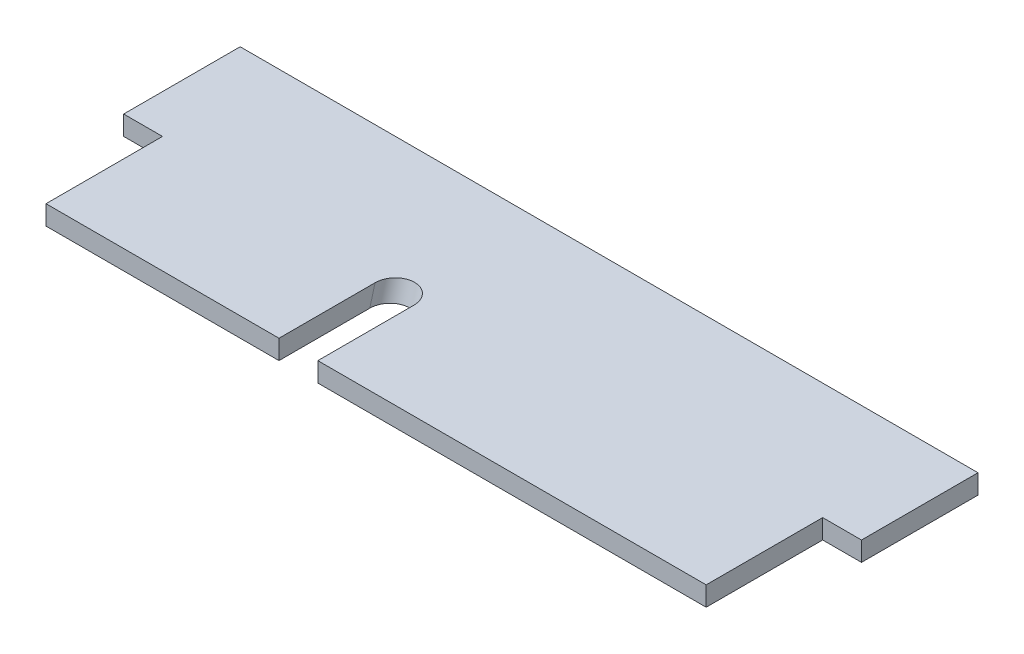
ISO-10303-21;
HEADER;
FILE_DESCRIPTION(('STEP AP214'),'2;1');
FILE_NAME('part.step','',(''),(''),'','','');
FILE_SCHEMA(('AUTOMOTIVE_DESIGN { 1 0 10303 214 1 1 1 1 }'));
ENDSEC;
DATA;
#1=APPLICATION_CONTEXT('core data for automotive mechanical design processes');
#2=APPLICATION_PROTOCOL_DEFINITION('international standard','automotive_design',2000,#1);
#3=PRODUCT_CONTEXT('',#1,'mechanical');
#4=PRODUCT('Part','Part','',(#3));
#5=PRODUCT_RELATED_PRODUCT_CATEGORY('part','',(#4));
#6=PRODUCT_DEFINITION_FORMATION('','',#4);
#7=PRODUCT_DEFINITION_CONTEXT('part definition',#1,'design');
#8=PRODUCT_DEFINITION('design','',#6,#7);
#9=PRODUCT_DEFINITION_SHAPE('','',#8);
#10=(LENGTH_UNIT() NAMED_UNIT(*) SI_UNIT(.MILLI.,.METRE.));
#11=(NAMED_UNIT(*) PLANE_ANGLE_UNIT() SI_UNIT($,.RADIAN.));
#12=(NAMED_UNIT(*) SI_UNIT($,.STERADIAN.) SOLID_ANGLE_UNIT());
#13=UNCERTAINTY_MEASURE_WITH_UNIT(LENGTH_MEASURE(1.E-05),#10,'distance_accuracy_value','');
#14=(GEOMETRIC_REPRESENTATION_CONTEXT(3) GLOBAL_UNCERTAINTY_ASSIGNED_CONTEXT((#13)) GLOBAL_UNIT_ASSIGNED_CONTEXT((#10,
#11,#12)) REPRESENTATION_CONTEXT('',''));
#15=CARTESIAN_POINT('',(0.,0.,0.));
#16=DIRECTION('',(0.,0.,1.));
#17=DIRECTION('',(1.,0.,0.));
#18=AXIS2_PLACEMENT_3D('',#15,#16,#17);
#19=CARTESIAN_POINT('',(-215.9,6.35,76.2));
#20=DIRECTION('',(0.,0.,-1.));
#21=DIRECTION('',(-1.,0.,0.));
#22=AXIS2_PLACEMENT_3D('',#19,#20,#21);
#23=PLANE('',#22);
#24=DIRECTION('',(1.,0.,0.));
#25=VECTOR('',#24,1.);
#26=CARTESIAN_POINT('',(-215.9,-6.35,76.2));
#27=LINE('',#26,#25);
#28=CARTESIAN_POINT('',(-215.9,-6.35,76.2));
#29=VERTEX_POINT('',#28);
#30=CARTESIAN_POINT('',(-63.5,-6.34999999999999,76.2));
#31=VERTEX_POINT('',#30);
#32=EDGE_CURVE('E214',#29,#31,#27,.T.);
#33=ORIENTED_EDGE('',*,*,#32,.T.);
#34=DIRECTION('',(0.,-1.,0.));
#35=VECTOR('',#34,1.);
#36=CARTESIAN_POINT('',(-63.5,6.34999999999999,76.2));
#37=LINE('',#36,#35);
#38=CARTESIAN_POINT('',(-63.5,6.34999999999999,76.2));
#39=VERTEX_POINT('',#38);
#40=EDGE_CURVE('E161',#39,#31,#37,.T.);
#41=ORIENTED_EDGE('',*,*,#40,.F.);
#42=DIRECTION('',(1.,0.,0.));
#43=VECTOR('',#42,1.);
#44=CARTESIAN_POINT('',(-215.9,6.35,76.2));
#45=LINE('',#44,#43);
#46=CARTESIAN_POINT('',(-215.9,6.35,76.2));
#47=VERTEX_POINT('',#46);
#48=EDGE_CURVE('E54',#47,#39,#45,.T.);
#49=ORIENTED_EDGE('',*,*,#48,.F.);
#50=DIRECTION('',(0.,-1.,0.));
#51=VECTOR('',#50,1.);
#52=CARTESIAN_POINT('',(-215.9,6.35,76.2));
#53=LINE('',#52,#51);
#54=EDGE_CURVE('E209',#47,#29,#53,.T.);
#55=ORIENTED_EDGE('',*,*,#54,.T.);
#56=EDGE_LOOP('',(#33,#41,#49,#55));
#57=FACE_BOUND('',#56,.T.);
#58=ADVANCED_FACE('F44',(#57),#23,.F.);
#59=CARTESIAN_POINT('',(215.9,6.35,0.));
#60=DIRECTION('',(-1.,0.,0.));
#61=DIRECTION('',(0.,0.,1.));
#62=AXIS2_PLACEMENT_3D('',#59,#60,#61);
#63=PLANE('',#62);
#64=DIRECTION('',(0.,0.,-1.));
#65=VECTOR('',#64,1.);
#66=CARTESIAN_POINT('',(215.9,-6.35,0.));
#67=LINE('',#66,#65);
#68=CARTESIAN_POINT('',(215.9,-6.35,76.2));
#69=VERTEX_POINT('',#68);
#70=CARTESIAN_POINT('',(215.9,-6.35,0.));
#71=VERTEX_POINT('',#70);
#72=EDGE_CURVE('E187',#69,#71,#67,.T.);
#73=ORIENTED_EDGE('',*,*,#72,.T.);
#74=DIRECTION('',(0.,-1.,0.));
#75=VECTOR('',#74,1.);
#76=CARTESIAN_POINT('',(215.9,6.35,0.));
#77=LINE('',#76,#75);
#78=CARTESIAN_POINT('',(215.9,6.35,0.));
#79=VERTEX_POINT('',#78);
#80=EDGE_CURVE('E250',#79,#71,#77,.T.);
#81=ORIENTED_EDGE('',*,*,#80,.F.);
#82=DIRECTION('',(0.,0.,-1.));
#83=VECTOR('',#82,1.);
#84=CARTESIAN_POINT('',(215.9,6.35,0.));
#85=LINE('',#84,#83);
#86=CARTESIAN_POINT('',(215.9,6.35,76.2));
#87=VERTEX_POINT('',#86);
#88=EDGE_CURVE('E203',#87,#79,#85,.T.);
#89=ORIENTED_EDGE('',*,*,#88,.F.);
#90=DIRECTION('',(0.,-1.,0.));
#91=VECTOR('',#90,1.);
#92=CARTESIAN_POINT('',(215.9,6.35,76.2));
#93=LINE('',#92,#91);
#94=EDGE_CURVE('E175',#87,#69,#93,.T.);
#95=ORIENTED_EDGE('',*,*,#94,.T.);
#96=EDGE_LOOP('',(#73,#81,#89,#95));
#97=FACE_BOUND('',#96,.T.);
#98=ADVANCED_FACE('F288',(#97),#63,.F.);
#99=CARTESIAN_POINT('',(215.9,6.35,0.));
#100=DIRECTION('',(0.,0.,-1.));
#101=DIRECTION('',(-1.,0.,0.));
#102=AXIS2_PLACEMENT_3D('',#99,#100,#101);
#103=PLANE('',#102);
#104=DIRECTION('',(1.,0.,0.));
#105=VECTOR('',#104,1.);
#106=CARTESIAN_POINT('',(215.9,-6.35,0.));
#107=LINE('',#106,#105);
#108=CARTESIAN_POINT('',(241.3,-6.35,0.));
#109=VERTEX_POINT('',#108);
#110=EDGE_CURVE('E229',#71,#109,#107,.T.);
#111=ORIENTED_EDGE('',*,*,#110,.T.);
#112=DIRECTION('',(0.,-1.,0.));
#113=VECTOR('',#112,1.);
#114=CARTESIAN_POINT('',(241.3,6.35,0.));
#115=LINE('',#114,#113);
#116=CARTESIAN_POINT('',(241.3,6.35,0.));
#117=VERTEX_POINT('',#116);
#118=EDGE_CURVE('E246',#117,#109,#115,.T.);
#119=ORIENTED_EDGE('',*,*,#118,.F.);
#120=DIRECTION('',(1.,0.,0.));
#121=VECTOR('',#120,1.);
#122=CARTESIAN_POINT('',(215.9,6.35,0.));
#123=LINE('',#122,#121);
#124=EDGE_CURVE('E201',#79,#117,#123,.T.);
#125=ORIENTED_EDGE('',*,*,#124,.F.);
#126=ORIENTED_EDGE('',*,*,#80,.T.);
#127=EDGE_LOOP('',(#111,#119,#125,#126));
#128=FACE_BOUND('',#127,.T.);
#129=ADVANCED_FACE('F311',(#128),#103,.F.);
#130=CARTESIAN_POINT('',(241.3,6.35,-76.2));
#131=DIRECTION('',(-1.,0.,0.));
#132=DIRECTION('',(0.,0.,1.));
#133=AXIS2_PLACEMENT_3D('',#130,#131,#132);
#134=PLANE('',#133);
#135=DIRECTION('',(0.,0.,-1.));
#136=VECTOR('',#135,1.);
#137=CARTESIAN_POINT('',(241.3,-6.35,-76.2));
#138=LINE('',#137,#136);
#139=CARTESIAN_POINT('',(241.3,-6.35,-76.2));
#140=VERTEX_POINT('',#139);
#141=EDGE_CURVE('E247',#109,#140,#138,.T.);
#142=ORIENTED_EDGE('',*,*,#141,.T.);
#143=DIRECTION('',(0.,-1.,0.));
#144=VECTOR('',#143,1.);
#145=CARTESIAN_POINT('',(241.3,6.35,-76.2));
#146=LINE('',#145,#144);
#147=CARTESIAN_POINT('',(241.3,6.35,-76.2));
#148=VERTEX_POINT('',#147);
#149=EDGE_CURVE('E242',#148,#140,#146,.T.);
#150=ORIENTED_EDGE('',*,*,#149,.F.);
#151=DIRECTION('',(0.,0.,-1.));
#152=VECTOR('',#151,1.);
#153=CARTESIAN_POINT('',(241.3,6.35,-76.2));
#154=LINE('',#153,#152);
#155=EDGE_CURVE('E198',#117,#148,#154,.T.);
#156=ORIENTED_EDGE('',*,*,#155,.F.);
#157=ORIENTED_EDGE('',*,*,#118,.T.);
#158=EDGE_LOOP('',(#142,#150,#156,#157));
#159=FACE_BOUND('',#158,.T.);
#160=ADVANCED_FACE('F309',(#159),#134,.F.);
#161=CARTESIAN_POINT('',(-215.9,6.35,-76.2));
#162=DIRECTION('',(0.,0.,1.));
#163=DIRECTION('',(1.,0.,0.));
#164=AXIS2_PLACEMENT_3D('',#161,#162,#163);
#165=PLANE('',#164);
#166=DIRECTION('',(-1.,0.,0.));
#167=VECTOR('',#166,1.);
#168=CARTESIAN_POINT('',(-215.9,-6.35,-76.2));
#169=LINE('',#168,#167);
#170=CARTESIAN_POINT('',(-241.3,-6.35,-76.2));
#171=VERTEX_POINT('',#170);
#172=EDGE_CURVE('E243',#140,#171,#169,.T.);
#173=ORIENTED_EDGE('',*,*,#172,.T.);
#174=DIRECTION('',(0.,-1.,0.));
#175=VECTOR('',#174,1.);
#176=CARTESIAN_POINT('',(-241.3,6.35,-76.2));
#177=LINE('',#176,#175);
#178=CARTESIAN_POINT('',(-241.3,6.35,-76.2));
#179=VERTEX_POINT('',#178);
#180=EDGE_CURVE('E238',#179,#171,#177,.T.);
#181=ORIENTED_EDGE('',*,*,#180,.F.);
#182=DIRECTION('',(-1.,0.,0.));
#183=VECTOR('',#182,1.);
#184=CARTESIAN_POINT('',(215.9,6.35,-76.2));
#185=LINE('',#184,#183);
#186=EDGE_CURVE('E195',#148,#179,#185,.T.);
#187=ORIENTED_EDGE('',*,*,#186,.F.);
#188=ORIENTED_EDGE('',*,*,#149,.T.);
#189=EDGE_LOOP('',(#173,#181,#187,#188));
#190=FACE_BOUND('',#189,.T.);
#191=ADVANCED_FACE('F306',(#190),#165,.F.);
#192=CARTESIAN_POINT('',(-241.3,6.35,-76.2));
#193=DIRECTION('',(1.,0.,0.));
#194=DIRECTION('',(0.,0.,-1.));
#195=AXIS2_PLACEMENT_3D('',#192,#193,#194);
#196=PLANE('',#195);
#197=DIRECTION('',(0.,0.,1.));
#198=VECTOR('',#197,1.);
#199=CARTESIAN_POINT('',(-241.3,-6.35,-76.2));
#200=LINE('',#199,#198);
#201=CARTESIAN_POINT('',(-241.3,-6.35,0.));
#202=VERTEX_POINT('',#201);
#203=EDGE_CURVE('E239',#171,#202,#200,.T.);
#204=ORIENTED_EDGE('',*,*,#203,.T.);
#205=DIRECTION('',(0.,-1.,0.));
#206=VECTOR('',#205,1.);
#207=CARTESIAN_POINT('',(-241.3,6.35,0.));
#208=LINE('',#207,#206);
#209=CARTESIAN_POINT('',(-241.3,6.35,0.));
#210=VERTEX_POINT('',#209);
#211=EDGE_CURVE('E234',#210,#202,#208,.T.);
#212=ORIENTED_EDGE('',*,*,#211,.F.);
#213=DIRECTION('',(0.,0.,1.));
#214=VECTOR('',#213,1.);
#215=CARTESIAN_POINT('',(-241.3,6.35,-76.2));
#216=LINE('',#215,#214);
#217=EDGE_CURVE('E192',#179,#210,#216,.T.);
#218=ORIENTED_EDGE('',*,*,#217,.F.);
#219=ORIENTED_EDGE('',*,*,#180,.T.);
#220=EDGE_LOOP('',(#204,#212,#218,#219));
#221=FACE_BOUND('',#220,.T.);
#222=ADVANCED_FACE('F304',(#221),#196,.F.);
#223=CARTESIAN_POINT('',(-215.9,6.35,0.));
#224=DIRECTION('',(0.,0.,-1.));
#225=DIRECTION('',(-1.,0.,0.));
#226=AXIS2_PLACEMENT_3D('',#223,#224,#225);
#227=PLANE('',#226);
#228=DIRECTION('',(1.,0.,0.));
#229=VECTOR('',#228,1.);
#230=CARTESIAN_POINT('',(-215.9,-6.35,0.));
#231=LINE('',#230,#229);
#232=CARTESIAN_POINT('',(-215.9,-6.35,0.));
#233=VERTEX_POINT('',#232);
#234=EDGE_CURVE('E235',#202,#233,#231,.T.);
#235=ORIENTED_EDGE('',*,*,#234,.T.);
#236=DIRECTION('',(0.,-1.,0.));
#237=VECTOR('',#236,1.);
#238=CARTESIAN_POINT('',(-215.9,6.35,0.));
#239=LINE('',#238,#237);
#240=CARTESIAN_POINT('',(-215.9,6.35,0.));
#241=VERTEX_POINT('',#240);
#242=EDGE_CURVE('E227',#241,#233,#239,.T.);
#243=ORIENTED_EDGE('',*,*,#242,.F.);
#244=DIRECTION('',(1.,0.,0.));
#245=VECTOR('',#244,1.);
#246=CARTESIAN_POINT('',(-215.9,6.35,0.));
#247=LINE('',#246,#245);
#248=EDGE_CURVE('E184',#210,#241,#247,.T.);
#249=ORIENTED_EDGE('',*,*,#248,.F.);
#250=ORIENTED_EDGE('',*,*,#211,.T.);
#251=EDGE_LOOP('',(#235,#243,#249,#250));
#252=FACE_BOUND('',#251,.T.);
#253=ADVANCED_FACE('F273',(#252),#227,.F.);
#254=CARTESIAN_POINT('',(-215.9,6.35,0.));
#255=DIRECTION('',(1.,0.,0.));
#256=DIRECTION('',(0.,0.,-1.));
#257=AXIS2_PLACEMENT_3D('',#254,#255,#256);
#258=PLANE('',#257);
#259=DIRECTION('',(0.,0.,1.));
#260=VECTOR('',#259,1.);
#261=CARTESIAN_POINT('',(-215.9,-6.35,0.));
#262=LINE('',#261,#260);
#263=EDGE_CURVE('E231',#233,#29,#262,.T.);
#264=ORIENTED_EDGE('',*,*,#263,.T.);
#265=ORIENTED_EDGE('',*,*,#54,.F.);
#266=DIRECTION('',(0.,0.,1.));
#267=VECTOR('',#266,1.);
#268=CARTESIAN_POINT('',(-215.9,6.35,0.));
#269=LINE('',#268,#267);
#270=EDGE_CURVE('E178',#241,#47,#269,.T.);
#271=ORIENTED_EDGE('',*,*,#270,.F.);
#272=ORIENTED_EDGE('',*,*,#242,.T.);
#273=EDGE_LOOP('',(#264,#265,#271,#272));
#274=FACE_BOUND('',#273,.T.);
#275=ADVANCED_FACE('F284',(#274),#258,.F.);
#276=CARTESIAN_POINT('',(-38.0999999999998,6.34999999999999,76.2));
#277=VERTEX_POINT('',#276);
#278=EDGE_CURVE('E167',#277,#87,#45,.T.);
#279=ORIENTED_EDGE('',*,*,#278,.F.);
#280=DIRECTION('',(0.,1.,0.));
#281=VECTOR('',#280,1.);
#282=CARTESIAN_POINT('',(-38.0999999999998,6.34999999999999,76.2));
#283=LINE('',#282,#281);
#284=CARTESIAN_POINT('',(-38.0999999999998,-6.35,76.2));
#285=VERTEX_POINT('',#284);
#286=EDGE_CURVE('E152',#285,#277,#283,.T.);
#287=ORIENTED_EDGE('',*,*,#286,.F.);
#288=EDGE_CURVE('E223',#285,#69,#27,.T.);
#289=ORIENTED_EDGE('',*,*,#288,.T.);
#290=ORIENTED_EDGE('',*,*,#94,.F.);
#291=EDGE_LOOP('',(#279,#287,#289,#290));
#292=FACE_BOUND('',#291,.T.);
#293=ADVANCED_FACE('F173',(#292),#23,.F.);
#294=CARTESIAN_POINT('',(0.,6.35,0.));
#295=DIRECTION('',(0.,1.,0.));
#296=DIRECTION('',(0.,0.,1.));
#297=AXIS2_PLACEMENT_3D('',#294,#295,#296);
#298=PLANE('',#297);
#299=DIRECTION('',(0.,0.,1.));
#300=VECTOR('',#299,1.);
#301=CARTESIAN_POINT('',(-63.5,6.34999999999999,-76.201));
#302=LINE('',#301,#300);
#303=CARTESIAN_POINT('',(-63.4999999999993,6.34999999999999,13.3639769330719));
#304=VERTEX_POINT('',#303);
#305=EDGE_CURVE('E171',#304,#39,#302,.T.);
#306=ORIENTED_EDGE('',*,*,#305,.F.);
#307=CARTESIAN_POINT('',(-50.7999999999986,6.34999999999999,13.3639769330719));
#308=DIRECTION('',(0.,1.,0.));
#309=DIRECTION('',(0.,0.,-1.));
#310=AXIS2_PLACEMENT_3D('',#307,#308,#309);
#311=ELLIPSE('',#310,13.1581302597941,12.7000000000001);
#312=CARTESIAN_POINT('',(-38.0999999999985,6.34999999999999,13.3639769330719));
#313=VERTEX_POINT('',#312);
#314=EDGE_CURVE('E48',#304,#313,#311,.F.);
#315=ORIENTED_EDGE('',*,*,#314,.T.);
#316=DIRECTION('',(0.,0.,1.));
#317=VECTOR('',#316,1.);
#318=CARTESIAN_POINT('',(-38.0999999999998,6.34999999999999,-76.201));
#319=LINE('',#318,#317);
#320=EDGE_CURVE('E74',#313,#277,#319,.T.);
#321=ORIENTED_EDGE('',*,*,#320,.T.);
#322=ORIENTED_EDGE('',*,*,#278,.T.);
#323=ORIENTED_EDGE('',*,*,#88,.T.);
#324=ORIENTED_EDGE('',*,*,#124,.T.);
#325=ORIENTED_EDGE('',*,*,#155,.T.);
#326=ORIENTED_EDGE('',*,*,#186,.T.);
#327=ORIENTED_EDGE('',*,*,#217,.T.);
#328=ORIENTED_EDGE('',*,*,#248,.T.);
#329=ORIENTED_EDGE('',*,*,#270,.T.);
#330=ORIENTED_EDGE('',*,*,#48,.T.);
#331=EDGE_LOOP('',(#306,#315,#321,#322,#323,#324,#325,#326,#327,#328,#329,#330));
#332=FACE_BOUND('',#331,.T.);
#333=ADVANCED_FACE('F46',(#332),#298,.T.);
#334=CARTESIAN_POINT('',(0.,-6.35,0.));
#335=DIRECTION('',(0.,1.,0.));
#336=DIRECTION('',(0.,0.,1.));
#337=AXIS2_PLACEMENT_3D('',#334,#335,#336);
#338=PLANE('',#337);
#339=CARTESIAN_POINT('',(-50.7999999999986,-6.34999999999999,16.8058357235667));
#340=DIRECTION('',(0.,1.,0.));
#341=DIRECTION('',(0.,0.,-1.));
#342=AXIS2_PLACEMENT_3D('',#339,#340,#341);
#343=ELLIPSE('',#342,13.1581302597941,12.7000000000001);
#344=CARTESIAN_POINT('',(-63.4999999999987,-6.34999999999999,16.8058357235667));
#345=VERTEX_POINT('',#344);
#346=CARTESIAN_POINT('',(-38.0999999999985,-6.34999999999999,16.8058357235667));
#347=VERTEX_POINT('',#346);
#348=EDGE_CURVE('E11',#345,#347,#343,.F.);
#349=ORIENTED_EDGE('',*,*,#348,.F.);
#350=DIRECTION('',(0.,0.,1.));
#351=VECTOR('',#350,1.);
#352=CARTESIAN_POINT('',(-63.5,-6.34999999999999,-76.201));
#353=LINE('',#352,#351);
#354=EDGE_CURVE('E65',#345,#31,#353,.T.);
#355=ORIENTED_EDGE('',*,*,#354,.T.);
#356=ORIENTED_EDGE('',*,*,#32,.F.);
#357=ORIENTED_EDGE('',*,*,#263,.F.);
#358=ORIENTED_EDGE('',*,*,#234,.F.);
#359=ORIENTED_EDGE('',*,*,#203,.F.);
#360=ORIENTED_EDGE('',*,*,#172,.F.);
#361=ORIENTED_EDGE('',*,*,#141,.F.);
#362=ORIENTED_EDGE('',*,*,#110,.F.);
#363=ORIENTED_EDGE('',*,*,#72,.F.);
#364=ORIENTED_EDGE('',*,*,#288,.F.);
#365=DIRECTION('',(0.,0.,1.));
#366=VECTOR('',#365,1.);
#367=CARTESIAN_POINT('',(-38.0999999999998,-6.35,-76.201));
#368=LINE('',#367,#366);
#369=EDGE_CURVE('E155',#347,#285,#368,.T.);
#370=ORIENTED_EDGE('',*,*,#369,.F.);
#371=EDGE_LOOP('',(#349,#355,#356,#357,#358,#359,#360,#361,#362,#363,#364,#370));
#372=FACE_BOUND('',#371,.T.);
#373=ADVANCED_FACE('F282',(#372),#338,.F.);
#374=CARTESIAN_POINT('',(-50.7999999999986,-171.450000000005,61.5499999999998));
#375=DIRECTION('',(0.,0.965182723476006,-0.261576585923588));
#376=DIRECTION('',(0.,-0.261576585923588,-0.965182723476006));
#377=AXIS2_PLACEMENT_3D('',#374,#375,#376);
#378=CYLINDRICAL_SURFACE('',#377,12.7000000000001);
#379=DIRECTION('',(0.,0.965182723476006,-0.261576585923588));
#380=VECTOR('',#379,1.);
#381=CARTESIAN_POINT('',(-63.4999999999994,-171.450000000005,61.5499999999998));
#382=LINE('',#381,#380);
#383=EDGE_CURVE('E160',#304,#345,#382,.F.);
#384=ORIENTED_EDGE('',*,*,#383,.T.);
#385=ORIENTED_EDGE('',*,*,#348,.T.);
#386=DIRECTION('',(0.,0.965182723476006,-0.261576585923588));
#387=VECTOR('',#386,1.);
#388=CARTESIAN_POINT('',(-38.0999999999991,-171.450000000005,61.5499999999998));
#389=LINE('',#388,#387);
#390=EDGE_CURVE('E291',#313,#347,#389,.F.);
#391=ORIENTED_EDGE('',*,*,#390,.F.);
#392=ORIENTED_EDGE('',*,*,#314,.F.);
#393=EDGE_LOOP('',(#384,#385,#391,#392));
#394=FACE_BOUND('',#393,.T.);
#395=ADVANCED_FACE('F384',(#394),#378,.F.);
#396=CARTESIAN_POINT('',(-38.0999999999998,6.34999999999999,-76.201));
#397=DIRECTION('',(1.,0.,0.));
#398=DIRECTION('',(0.,1.,0.));
#399=AXIS2_PLACEMENT_3D('',#396,#397,#398);
#400=PLANE('',#399);
#401=ORIENTED_EDGE('',*,*,#390,.T.);
#402=ORIENTED_EDGE('',*,*,#369,.T.);
#403=ORIENTED_EDGE('',*,*,#286,.T.);
#404=ORIENTED_EDGE('',*,*,#320,.F.);
#405=EDGE_LOOP('',(#401,#402,#403,#404));
#406=FACE_BOUND('',#405,.T.);
#407=ADVANCED_FACE('F153',(#406),#400,.F.);
#408=CARTESIAN_POINT('',(-63.5,6.34999999999999,-76.201));
#409=DIRECTION('',(-1.,0.,0.));
#410=DIRECTION('',(0.,0.,1.));
#411=AXIS2_PLACEMENT_3D('',#408,#409,#410);
#412=PLANE('',#411);
#413=ORIENTED_EDGE('',*,*,#305,.T.);
#414=ORIENTED_EDGE('',*,*,#40,.T.);
#415=ORIENTED_EDGE('',*,*,#354,.F.);
#416=ORIENTED_EDGE('',*,*,#383,.F.);
#417=EDGE_LOOP('',(#413,#414,#415,#416));
#418=FACE_BOUND('',#417,.T.);
#419=ADVANCED_FACE('F401',(#418),#412,.F.);
#420=CLOSED_SHELL('',(#58,#98,#129,#160,#191,#222,#253,#275,#293,#333,#373,#395,#407,#419));
#421=MANIFOLD_SOLID_BREP('B2',#420);
#422=ADVANCED_BREP_SHAPE_REPRESENTATION('',(#18,#421),#14);
#423=SHAPE_DEFINITION_REPRESENTATION(#9,#422);
ENDSEC;
END-ISO-10303-21;
